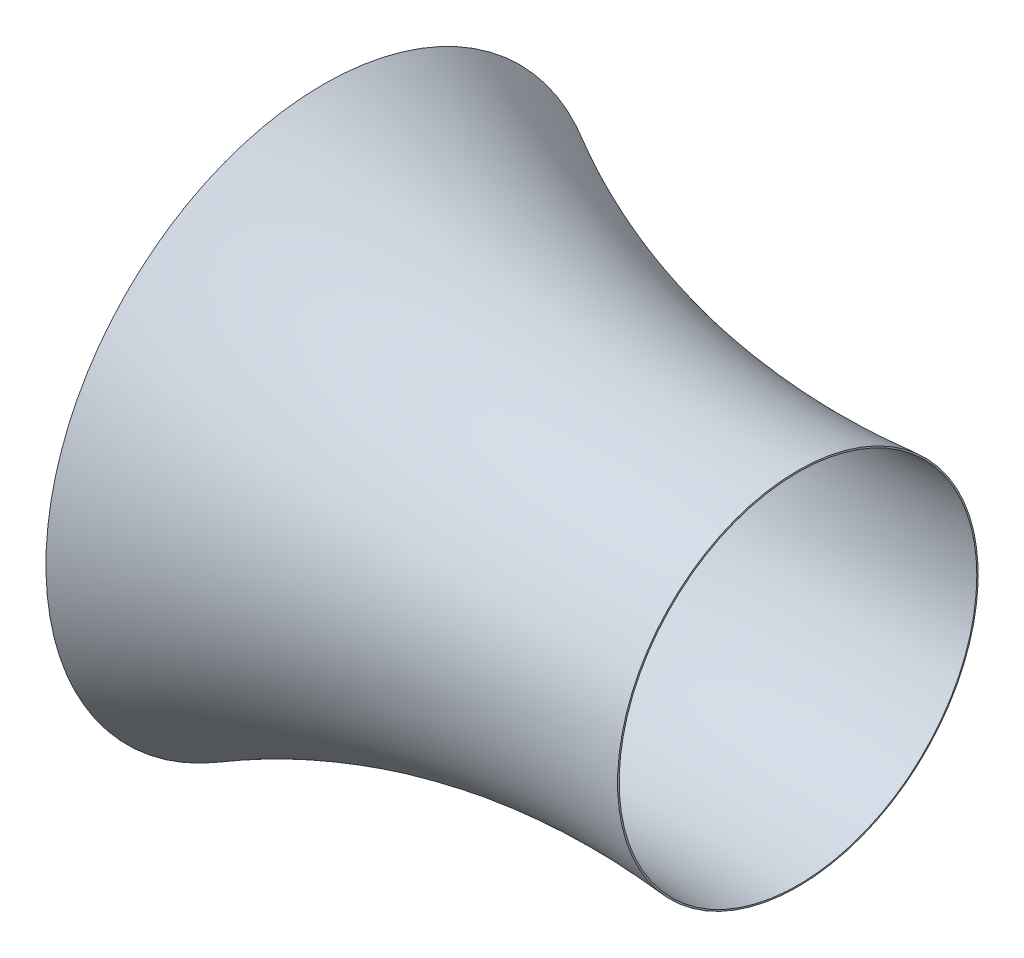
ISO-10303-21;
HEADER;
FILE_DESCRIPTION(('STEP AP214'),'2;1');
FILE_NAME('part.step','',(''),(''),'','','');
FILE_SCHEMA(('AUTOMOTIVE_DESIGN { 1 0 10303 214 1 1 1 1 }'));
ENDSEC;
DATA;
#1=APPLICATION_CONTEXT('core data for automotive mechanical design processes');
#2=APPLICATION_PROTOCOL_DEFINITION('international standard','automotive_design',2000,#1);
#3=PRODUCT_CONTEXT('',#1,'mechanical');
#4=PRODUCT('Part','Part','',(#3));
#5=PRODUCT_RELATED_PRODUCT_CATEGORY('part','',(#4));
#6=PRODUCT_DEFINITION_FORMATION('','',#4);
#7=PRODUCT_DEFINITION_CONTEXT('part definition',#1,'design');
#8=PRODUCT_DEFINITION('design','',#6,#7);
#9=PRODUCT_DEFINITION_SHAPE('','',#8);
#10=(LENGTH_UNIT() NAMED_UNIT(*) SI_UNIT(.MILLI.,.METRE.));
#11=(NAMED_UNIT(*) PLANE_ANGLE_UNIT() SI_UNIT($,.RADIAN.));
#12=(NAMED_UNIT(*) SI_UNIT($,.STERADIAN.) SOLID_ANGLE_UNIT());
#13=UNCERTAINTY_MEASURE_WITH_UNIT(LENGTH_MEASURE(1.E-05),#10,'distance_accuracy_value','');
#14=(GEOMETRIC_REPRESENTATION_CONTEXT(3) GLOBAL_UNCERTAINTY_ASSIGNED_CONTEXT((#13)) GLOBAL_UNIT_ASSIGNED_CONTEXT((#10,
#11,#12)) REPRESENTATION_CONTEXT('',''));
#15=CARTESIAN_POINT('',(0.,0.,0.));
#16=DIRECTION('',(0.,0.,1.));
#17=DIRECTION('',(1.,0.,0.));
#18=AXIS2_PLACEMENT_3D('',#15,#16,#17);
#19=CARTESIAN_POINT('',(58.1645223558109,0.,0.));
#20=DIRECTION('',(-1.,0.,0.));
#21=DIRECTION('',(0.,0.,1.));
#22=AXIS2_PLACEMENT_3D('',#19,#20,#21);
#23=PLANE('',#22);
#24=CARTESIAN_POINT('',(58.1645223558109,0.,0.));
#25=DIRECTION('',(1.,0.,0.));
#26=DIRECTION('',(0.,0.,-1.));
#27=AXIS2_PLACEMENT_3D('',#24,#25,#26);
#28=CIRCLE('',#27,825.);
#29=CARTESIAN_POINT('',(58.1645223558109,0.,-825.));
#30=VERTEX_POINT('',#29);
#31=EDGE_CURVE('E51',#30,#30,#28,.T.);
#32=ORIENTED_EDGE('',*,*,#31,.F.);
#33=EDGE_LOOP('',(#32));
#34=FACE_BOUND('',#33,.T.);
#35=CARTESIAN_POINT('',(58.1645223558109,0.,0.));
#36=DIRECTION('',(1.,0.,0.));
#37=DIRECTION('',(0.,0.,-1.));
#38=AXIS2_PLACEMENT_3D('',#35,#36,#37);
#39=CIRCLE('',#38,830.);
#40=CARTESIAN_POINT('',(58.1645223558109,0.,-830.));
#41=VERTEX_POINT('',#40);
#42=EDGE_CURVE('E114',#41,#41,#39,.T.);
#43=ORIENTED_EDGE('',*,*,#42,.T.);
#44=EDGE_LOOP('',(#43));
#45=FACE_BOUND('',#44,.T.);
#46=ADVANCED_FACE('F33',(#34,#45),#23,.F.);
#47=CARTESIAN_POINT('',(1590.,0.,0.));
#48=DIRECTION('',(-1.,0.,0.));
#49=DIRECTION('',(0.,0.,1.));
#50=AXIS2_PLACEMENT_3D('',#47,#48,#49);
#51=CONICAL_SURFACE('',#50,600.,1.48046993471883);
#52=CARTESIAN_POINT('',(1589.54898192258,0.,0.));
#53=DIRECTION('',(1.,0.,0.));
#54=DIRECTION('',(0.,1.,0.));
#55=AXIS2_PLACEMENT_3D('',#52,#53,#54);
#56=CIRCLE('',#55,604.97961672158);
#57=CARTESIAN_POINT('',(1589.54898192258,604.97961672158,0.));
#58=VERTEX_POINT('',#57);
#59=EDGE_CURVE('E10',#58,#58,#56,.T.);
#60=ORIENTED_EDGE('',*,*,#59,.T.);
#61=EDGE_LOOP('',(#60));
#62=FACE_BOUND('',#61,.T.);
#63=CARTESIAN_POINT('',(1590.,0.,0.));
#64=DIRECTION('',(1.,0.,0.));
#65=DIRECTION('',(0.,0.,-1.));
#66=AXIS2_PLACEMENT_3D('',#63,#64,#65);
#67=CIRCLE('',#66,600.);
#68=CARTESIAN_POINT('',(1590.,0.,-600.));
#69=VERTEX_POINT('',#68);
#70=EDGE_CURVE('E36',#69,#69,#67,.T.);
#71=ORIENTED_EDGE('',*,*,#70,.F.);
#72=EDGE_LOOP('',(#71));
#73=FACE_BOUND('',#72,.T.);
#74=ADVANCED_FACE('F150',(#62,#73),#51,.T.);
#75=CARTESIAN_POINT('',(1590.,600.,0.));
#76=CARTESIAN_POINT('',(729.903432622277,522.098602782555,0.));
#77=CARTESIAN_POINT('',(-7.29903432622277,928.853327509514,0.));
#78=CARTESIAN_POINT('',(-14.5980686524455,932.880602011761,0.));
#79=B_SPLINE_CURVE_WITH_KNOTS('',2,(#75,#76,#77,#78),.UNSPECIFIED.,.F.,.F.,(3,1,3),(0.,1.,1.01),.UNSPECIFIED.);
#80=CARTESIAN_POINT('',(0.,0.,0.));
#81=DIRECTION('',(1.,0.,0.));
#82=AXIS1_PLACEMENT('',#80,#81);
#83=SURFACE_OF_REVOLUTION('',#79,#82);
#84=OFFSET_SURFACE('',#83,-5.,.F.);
#85=CARTESIAN_POINT('',(-1.75990773651504,0.,0.));
#86=DIRECTION('',(1.,0.,0.));
#87=DIRECTION('',(0.,0.,-1.));
#88=AXIS2_PLACEMENT_3D('',#85,#86,#87);
#89=CIRCLE('',#88,931.507678626307);
#90=CARTESIAN_POINT('',(-1.75990773651504,0.,-931.507678626307));
#91=VERTEX_POINT('',#90);
#92=EDGE_CURVE('E40',#91,#91,#89,.T.);
#93=ORIENTED_EDGE('',*,*,#92,.T.);
#94=EDGE_LOOP('',(#93));
#95=FACE_BOUND('',#94,.T.);
#96=ORIENTED_EDGE('',*,*,#59,.F.);
#97=EDGE_LOOP('',(#96));
#98=FACE_BOUND('',#97,.T.);
#99=ADVANCED_FACE('F70',(#95,#98),#84,.F.);
#100=CARTESIAN_POINT('',(2.49874807147443,928.887783454916,0.));
#101=CARTESIAN_POINT('',(1.24937403573722,926.856918231091,0.));
#102=CARTESIAN_POINT('',(-40.6448771597789,858.757553751386,0.));
#103=CARTESIAN_POINT('',(0.745532448811899,798.922234092078,0.));
#104=CARTESIAN_POINT('',(1.4910648976238,797.844468184157,0.));
#105=B_SPLINE_CURVE_WITH_KNOTS('',2,(#100,#101,#102,#103,#104),.UNSPECIFIED.,.F.,.F.,(3,1,1,3),
(-0.0307387824257854,0.,1.,1.01834259323459),.UNSPECIFIED.);
#106=CARTESIAN_POINT('',(0.,0.,0.));
#107=DIRECTION('',(1.,0.,0.));
#108=AXIS1_PLACEMENT('',#106,#107);
#109=SURFACE_OF_REVOLUTION('',#105,#108);
#110=OFFSET_SURFACE('',#109,-5.,.F.);
#111=CARTESIAN_POINT('',(-2.62099064058559,0.,0.));
#112=DIRECTION('',(1.,0.,0.));
#113=DIRECTION('',(0.,0.,-1.));
#114=AXIS2_PLACEMENT_3D('',#111,#112,#113);
#115=CIRCLE('',#114,795.);
#116=CARTESIAN_POINT('',(-2.62099064058559,0.,-795.));
#117=VERTEX_POINT('',#116);
#118=EDGE_CURVE('E45',#117,#117,#115,.T.);
#119=ORIENTED_EDGE('',*,*,#118,.T.);
#120=EDGE_LOOP('',(#119));
#121=FACE_BOUND('',#120,.T.);
#122=ORIENTED_EDGE('',*,*,#92,.F.);
#123=EDGE_LOOP('',(#122));
#124=FACE_BOUND('',#123,.T.);
#125=ADVANCED_FACE('F71',(#121,#124),#110,.F.);
#126=CARTESIAN_POINT('',(0.,0.,0.));
#127=DIRECTION('',(1.,0.,0.));
#128=DIRECTION('',(0.,0.,-1.));
#129=AXIS2_PLACEMENT_3D('',#126,#127,#128);
#130=CYLINDRICAL_SURFACE('',#129,795.);
#131=CARTESIAN_POINT('',(28.8211041168073,0.,0.));
#132=DIRECTION('',(1.,0.,0.));
#133=DIRECTION('',(0.,0.,-1.));
#134=AXIS2_PLACEMENT_3D('',#131,#132,#133);
#135=CIRCLE('',#134,795.);
#136=CARTESIAN_POINT('',(28.8211041168073,0.,-795.));
#137=VERTEX_POINT('',#136);
#138=EDGE_CURVE('E54',#137,#137,#135,.T.);
#139=ORIENTED_EDGE('',*,*,#138,.T.);
#140=EDGE_LOOP('',(#139));
#141=FACE_BOUND('',#140,.T.);
#142=ORIENTED_EDGE('',*,*,#118,.F.);
#143=EDGE_LOOP('',(#142));
#144=FACE_BOUND('',#143,.T.);
#145=ADVANCED_FACE('F74',(#141,#144),#130,.F.);
#146=CARTESIAN_POINT('',(29.8245244772304,0.,0.));
#147=DIRECTION('',(1.,0.,0.));
#148=DIRECTION('',(0.,0.,-1.));
#149=AXIS2_PLACEMENT_3D('',#146,#147,#148);
#150=CONICAL_SURFACE('',#149,798.687002068317,1.30508097022597);
#151=CARTESIAN_POINT('',(36.9856264726182,0.,0.));
#152=DIRECTION('',(1.,0.,0.));
#153=DIRECTION('',(0.,0.,-1.));
#154=AXIS2_PLACEMENT_3D('',#151,#152,#153);
#155=CIRCLE('',#154,825.);
#156=CARTESIAN_POINT('',(36.9856264726182,0.,-825.));
#157=VERTEX_POINT('',#156);
#158=EDGE_CURVE('E49',#157,#157,#155,.T.);
#159=ORIENTED_EDGE('',*,*,#158,.T.);
#160=EDGE_LOOP('',(#159));
#161=FACE_BOUND('',#160,.T.);
#162=ORIENTED_EDGE('',*,*,#138,.F.);
#163=EDGE_LOOP('',(#162));
#164=FACE_BOUND('',#163,.T.);
#165=ADVANCED_FACE('F80',(#161,#164),#150,.F.);
#166=CARTESIAN_POINT('',(0.,0.,0.));
#167=DIRECTION('',(1.,0.,0.));
#168=DIRECTION('',(0.,0.,-1.));
#169=AXIS2_PLACEMENT_3D('',#166,#167,#168);
#170=CYLINDRICAL_SURFACE('',#169,825.);
#171=ORIENTED_EDGE('',*,*,#31,.T.);
#172=EDGE_LOOP('',(#171));
#173=FACE_BOUND('',#172,.T.);
#174=ORIENTED_EDGE('',*,*,#158,.F.);
#175=EDGE_LOOP('',(#174));
#176=FACE_BOUND('',#175,.T.);
#177=ADVANCED_FACE('F84',(#173,#176),#170,.F.);
#178=CARTESIAN_POINT('',(1590.,600.,0.));
#179=CARTESIAN_POINT('',(729.903432622277,522.098602782555,0.));
#180=CARTESIAN_POINT('',(0.,924.826053007267,0.));
#181=B_SPLINE_CURVE_WITH_KNOTS('',2,(#178,#179,#180),.UNSPECIFIED.,.F.,.F.,(3,3),(0.,1.),.UNSPECIFIED.);
#182=CARTESIAN_POINT('',(0.,0.,0.));
#183=DIRECTION('',(1.,0.,0.));
#184=AXIS1_PLACEMENT('',#182,#183);
#185=SURFACE_OF_REVOLUTION('',#181,#184);
#186=CARTESIAN_POINT('',(0.,0.,0.));
#187=DIRECTION('',(1.,0.,0.));
#188=DIRECTION('',(0.,0.,-1.));
#189=AXIS2_PLACEMENT_3D('',#186,#187,#188);
#190=CIRCLE('',#189,924.826053007267);
#191=CARTESIAN_POINT('',(0.,0.,-924.826053007267));
#192=VERTEX_POINT('',#191);
#193=EDGE_CURVE('E128',#192,#192,#190,.T.);
#194=ORIENTED_EDGE('',*,*,#193,.F.);
#195=EDGE_LOOP('',(#194));
#196=FACE_BOUND('',#195,.T.);
#197=ORIENTED_EDGE('',*,*,#70,.T.);
#198=EDGE_LOOP('',(#197));
#199=FACE_BOUND('',#198,.T.);
#200=ADVANCED_FACE('F88',(#196,#199),#185,.T.);
#201=CARTESIAN_POINT('',(0.,924.826053007267,0.));
#202=CARTESIAN_POINT('',(-40.6448771597789,858.757553751386,0.));
#203=CARTESIAN_POINT('',(0.,800.,0.));
#204=B_SPLINE_CURVE_WITH_KNOTS('',2,(#201,#202,#203),.UNSPECIFIED.,.F.,.F.,(3,3),(0.,1.),.UNSPECIFIED.);
#205=CARTESIAN_POINT('',(0.,0.,0.));
#206=DIRECTION('',(1.,0.,0.));
#207=AXIS1_PLACEMENT('',#205,#206);
#208=SURFACE_OF_REVOLUTION('',#204,#207);
#209=CARTESIAN_POINT('',(0.,0.,0.));
#210=DIRECTION('',(1.,0.,0.));
#211=DIRECTION('',(0.,0.,-1.));
#212=AXIS2_PLACEMENT_3D('',#209,#210,#211);
#213=CIRCLE('',#212,800.);
#214=CARTESIAN_POINT('',(0.,0.,-800.));
#215=VERTEX_POINT('',#214);
#216=EDGE_CURVE('E126',#215,#215,#213,.T.);
#217=ORIENTED_EDGE('',*,*,#216,.F.);
#218=EDGE_LOOP('',(#217));
#219=FACE_BOUND('',#218,.T.);
#220=ORIENTED_EDGE('',*,*,#193,.T.);
#221=EDGE_LOOP('',(#220));
#222=FACE_BOUND('',#221,.T.);
#223=ADVANCED_FACE('F101',(#219,#222),#208,.T.);
#224=CARTESIAN_POINT('',(0.,0.,0.));
#225=DIRECTION('',(1.,0.,0.));
#226=DIRECTION('',(0.,0.,-1.));
#227=AXIS2_PLACEMENT_3D('',#224,#225,#226);
#228=CYLINDRICAL_SURFACE('',#227,800.);
#229=CARTESIAN_POINT('',(25.,0.,0.));
#230=DIRECTION('',(1.,0.,0.));
#231=DIRECTION('',(0.,0.,-1.));
#232=AXIS2_PLACEMENT_3D('',#229,#230,#231);
#233=CIRCLE('',#232,800.);
#234=CARTESIAN_POINT('',(25.,0.,-800.));
#235=VERTEX_POINT('',#234);
#236=EDGE_CURVE('E120',#235,#235,#233,.T.);
#237=ORIENTED_EDGE('',*,*,#236,.F.);
#238=EDGE_LOOP('',(#237));
#239=FACE_BOUND('',#238,.T.);
#240=ORIENTED_EDGE('',*,*,#216,.T.);
#241=EDGE_LOOP('',(#240));
#242=FACE_BOUND('',#241,.T.);
#243=ADVANCED_FACE('F97',(#239,#242),#228,.T.);
#244=CARTESIAN_POINT('',(25.,0.,0.));
#245=DIRECTION('',(1.,0.,0.));
#246=DIRECTION('',(0.,0.,-1.));
#247=AXIS2_PLACEMENT_3D('',#244,#245,#246);
#248=CONICAL_SURFACE('',#247,800.,1.30508097022597);
#249=CARTESIAN_POINT('',(33.1645223558109,0.,0.));
#250=DIRECTION('',(1.,0.,0.));
#251=DIRECTION('',(0.,0.,-1.));
#252=AXIS2_PLACEMENT_3D('',#249,#250,#251);
#253=CIRCLE('',#252,830.);
#254=CARTESIAN_POINT('',(33.1645223558109,0.,-830.));
#255=VERTEX_POINT('',#254);
#256=EDGE_CURVE('E121',#255,#255,#253,.T.);
#257=ORIENTED_EDGE('',*,*,#256,.F.);
#258=EDGE_LOOP('',(#257));
#259=FACE_BOUND('',#258,.T.);
#260=ORIENTED_EDGE('',*,*,#236,.T.);
#261=EDGE_LOOP('',(#260));
#262=FACE_BOUND('',#261,.T.);
#263=ADVANCED_FACE('F93',(#259,#262),#248,.T.);
#264=CARTESIAN_POINT('',(0.,0.,0.));
#265=DIRECTION('',(1.,0.,0.));
#266=DIRECTION('',(0.,0.,-1.));
#267=AXIS2_PLACEMENT_3D('',#264,#265,#266);
#268=CYLINDRICAL_SURFACE('',#267,830.);
#269=ORIENTED_EDGE('',*,*,#42,.F.);
#270=EDGE_LOOP('',(#269));
#271=FACE_BOUND('',#270,.T.);
#272=ORIENTED_EDGE('',*,*,#256,.T.);
#273=EDGE_LOOP('',(#272));
#274=FACE_BOUND('',#273,.T.);
#275=ADVANCED_FACE('F90',(#271,#274),#268,.T.);
#276=CLOSED_SHELL('',(#46,#74,#99,#125,#145,#165,#177,#200,#223,#243,#263,#275));
#277=MANIFOLD_SOLID_BREP('B2',#276);
#278=ADVANCED_BREP_SHAPE_REPRESENTATION('',(#18,#277),#14);
#279=SHAPE_DEFINITION_REPRESENTATION(#9,#278);
ENDSEC;
END-ISO-10303-21;
